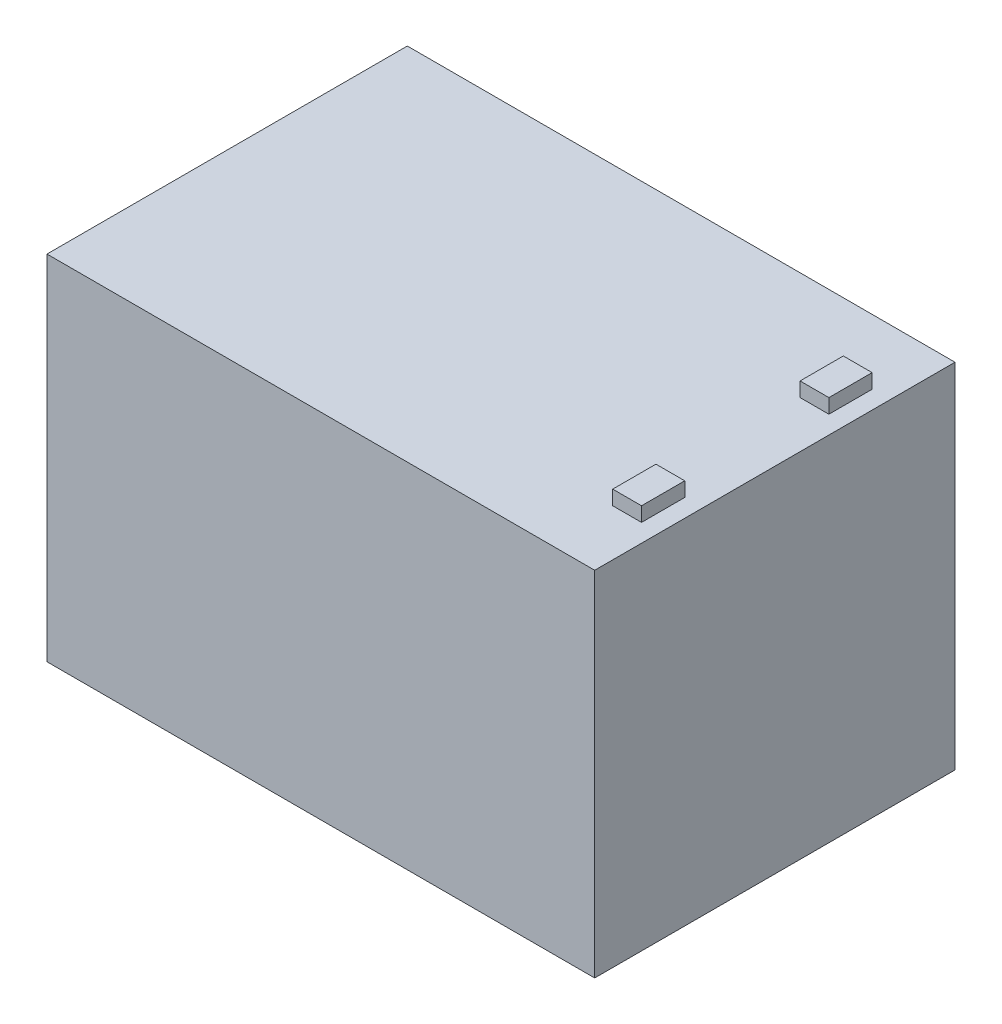
ISO-10303-21;
HEADER;
FILE_DESCRIPTION(('STEP AP214'),'2;1');
FILE_NAME('part.step','',(''),(''),'','','');
FILE_SCHEMA(('AUTOMOTIVE_DESIGN { 1 0 10303 214 1 1 1 1 }'));
ENDSEC;
DATA;
#1=APPLICATION_CONTEXT('core data for automotive mechanical design processes');
#2=APPLICATION_PROTOCOL_DEFINITION('international standard','automotive_design',2000,#1);
#3=PRODUCT_CONTEXT('',#1,'mechanical');
#4=PRODUCT('Part','Part','',(#3));
#5=PRODUCT_RELATED_PRODUCT_CATEGORY('part','',(#4));
#6=PRODUCT_DEFINITION_FORMATION('','',#4);
#7=PRODUCT_DEFINITION_CONTEXT('part definition',#1,'design');
#8=PRODUCT_DEFINITION('design','',#6,#7);
#9=PRODUCT_DEFINITION_SHAPE('','',#8);
#10=(LENGTH_UNIT() NAMED_UNIT(*) SI_UNIT(.MILLI.,.METRE.));
#11=(NAMED_UNIT(*) PLANE_ANGLE_UNIT() SI_UNIT($,.RADIAN.));
#12=(NAMED_UNIT(*) SI_UNIT($,.STERADIAN.) SOLID_ANGLE_UNIT());
#13=UNCERTAINTY_MEASURE_WITH_UNIT(LENGTH_MEASURE(1.E-05),#10,'distance_accuracy_value','');
#14=(GEOMETRIC_REPRESENTATION_CONTEXT(3) GLOBAL_UNCERTAINTY_ASSIGNED_CONTEXT((#13)) GLOBAL_UNIT_ASSIGNED_CONTEXT((#10,
#11,#12)) REPRESENTATION_CONTEXT('',''));
#15=CARTESIAN_POINT('',(0.,0.,0.));
#16=DIRECTION('',(0.,0.,1.));
#17=DIRECTION('',(1.,0.,0.));
#18=AXIS2_PLACEMENT_3D('',#15,#16,#17);
#19=CARTESIAN_POINT('',(-76.,49.,100.));
#20=DIRECTION('',(0.,-1.,0.));
#21=DIRECTION('',(0.,0.,-1.));
#22=AXIS2_PLACEMENT_3D('',#19,#20,#21);
#23=PLANE('',#22);
#24=DIRECTION('',(0.,0.,-1.));
#25=VECTOR('',#24,1.);
#26=CARTESIAN_POINT('',(71.,49.,18.));
#27=LINE('',#26,#25);
#28=CARTESIAN_POINT('',(71.,49.,30.));
#29=VERTEX_POINT('',#28);
#30=CARTESIAN_POINT('',(71.,49.,18.));
#31=VERTEX_POINT('',#30);
#32=EDGE_CURVE('E145',#29,#31,#27,.T.);
#33=ORIENTED_EDGE('',*,*,#32,.F.);
#34=DIRECTION('',(1.,0.,0.));
#35=VECTOR('',#34,1.);
#36=CARTESIAN_POINT('',(63.,49.,30.));
#37=LINE('',#36,#35);
#38=CARTESIAN_POINT('',(63.,49.,30.));
#39=VERTEX_POINT('',#38);
#40=EDGE_CURVE('E158',#39,#29,#37,.T.);
#41=ORIENTED_EDGE('',*,*,#40,.F.);
#42=DIRECTION('',(0.,0.,1.));
#43=VECTOR('',#42,1.);
#44=CARTESIAN_POINT('',(63.,49.,18.));
#45=LINE('',#44,#43);
#46=CARTESIAN_POINT('',(63.,49.,18.));
#47=VERTEX_POINT('',#46);
#48=EDGE_CURVE('E167',#47,#39,#45,.T.);
#49=ORIENTED_EDGE('',*,*,#48,.F.);
#50=DIRECTION('',(-1.,0.,0.));
#51=VECTOR('',#50,1.);
#52=CARTESIAN_POINT('',(63.,49.,18.));
#53=LINE('',#52,#51);
#54=EDGE_CURVE('E148',#31,#47,#53,.T.);
#55=ORIENTED_EDGE('',*,*,#54,.F.);
#56=EDGE_LOOP('',(#33,#41,#49,#55));
#57=FACE_BOUND('',#56,.T.);
#58=DIRECTION('',(-1.,0.,0.));
#59=VECTOR('',#58,1.);
#60=CARTESIAN_POINT('',(-76.,49.,0.));
#61=LINE('',#60,#59);
#62=CARTESIAN_POINT('',(76.,49.,0.));
#63=VERTEX_POINT('',#62);
#64=CARTESIAN_POINT('',(-76.,49.,0.));
#65=VERTEX_POINT('',#64);
#66=EDGE_CURVE('E197',#63,#65,#61,.T.);
#67=ORIENTED_EDGE('',*,*,#66,.T.);
#68=DIRECTION('',(0.,0.,-1.));
#69=VECTOR('',#68,1.);
#70=CARTESIAN_POINT('',(-76.,49.,100.));
#71=LINE('',#70,#69);
#72=CARTESIAN_POINT('',(-76.,49.,100.));
#73=VERTEX_POINT('',#72);
#74=EDGE_CURVE('E43',#73,#65,#71,.T.);
#75=ORIENTED_EDGE('',*,*,#74,.F.);
#76=DIRECTION('',(-1.,0.,0.));
#77=VECTOR('',#76,1.);
#78=CARTESIAN_POINT('',(-76.,49.,100.));
#79=LINE('',#78,#77);
#80=CARTESIAN_POINT('',(76.,49.,100.));
#81=VERTEX_POINT('',#80);
#82=EDGE_CURVE('E187',#81,#73,#79,.T.);
#83=ORIENTED_EDGE('',*,*,#82,.F.);
#84=DIRECTION('',(0.,0.,-1.));
#85=VECTOR('',#84,1.);
#86=CARTESIAN_POINT('',(76.,49.,100.));
#87=LINE('',#86,#85);
#88=EDGE_CURVE('E11',#81,#63,#87,.T.);
#89=ORIENTED_EDGE('',*,*,#88,.T.);
#90=EDGE_LOOP('',(#67,#75,#83,#89));
#91=FACE_BOUND('',#90,.T.);
#92=DIRECTION('',(0.,0.,-1.));
#93=VECTOR('',#92,1.);
#94=CARTESIAN_POINT('',(71.,49.,70.));
#95=LINE('',#94,#93);
#96=CARTESIAN_POINT('',(71.,49.,82.));
#97=VERTEX_POINT('',#96);
#98=CARTESIAN_POINT('',(71.,49.,70.));
#99=VERTEX_POINT('',#98);
#100=EDGE_CURVE('E144',#97,#99,#95,.T.);
#101=ORIENTED_EDGE('',*,*,#100,.F.);
#102=DIRECTION('',(1.,0.,0.));
#103=VECTOR('',#102,1.);
#104=CARTESIAN_POINT('',(63.,49.,82.));
#105=LINE('',#104,#103);
#106=CARTESIAN_POINT('',(63.,49.,82.));
#107=VERTEX_POINT('',#106);
#108=EDGE_CURVE('E141',#107,#97,#105,.T.);
#109=ORIENTED_EDGE('',*,*,#108,.F.);
#110=DIRECTION('',(0.,0.,1.));
#111=VECTOR('',#110,1.);
#112=CARTESIAN_POINT('',(63.,49.,70.));
#113=LINE('',#112,#111);
#114=CARTESIAN_POINT('',(63.,49.,70.));
#115=VERTEX_POINT('',#114);
#116=EDGE_CURVE('E55',#115,#107,#113,.T.);
#117=ORIENTED_EDGE('',*,*,#116,.F.);
#118=DIRECTION('',(-1.,0.,0.));
#119=VECTOR('',#118,1.);
#120=CARTESIAN_POINT('',(63.,49.,70.));
#121=LINE('',#120,#119);
#122=EDGE_CURVE('E50',#99,#115,#121,.T.);
#123=ORIENTED_EDGE('',*,*,#122,.F.);
#124=EDGE_LOOP('',(#101,#109,#117,#123));
#125=FACE_BOUND('',#124,.T.);
#126=ADVANCED_FACE('F35',(#57,#91,#125),#23,.F.);
#127=CARTESIAN_POINT('',(76.,-49.,100.));
#128=DIRECTION('',(-1.,0.,0.));
#129=DIRECTION('',(0.,0.,1.));
#130=AXIS2_PLACEMENT_3D('',#127,#128,#129);
#131=PLANE('',#130);
#132=DIRECTION('',(0.,1.,0.));
#133=VECTOR('',#132,1.);
#134=CARTESIAN_POINT('',(76.,-49.,0.));
#135=LINE('',#134,#133);
#136=CARTESIAN_POINT('',(76.,-49.,0.));
#137=VERTEX_POINT('',#136);
#138=EDGE_CURVE('E183',#137,#63,#135,.T.);
#139=ORIENTED_EDGE('',*,*,#138,.T.);
#140=ORIENTED_EDGE('',*,*,#88,.F.);
#141=DIRECTION('',(0.,1.,0.));
#142=VECTOR('',#141,1.);
#143=CARTESIAN_POINT('',(76.,-49.,100.));
#144=LINE('',#143,#142);
#145=CARTESIAN_POINT('',(76.,-49.,100.));
#146=VERTEX_POINT('',#145);
#147=EDGE_CURVE('E184',#146,#81,#144,.T.);
#148=ORIENTED_EDGE('',*,*,#147,.F.);
#149=DIRECTION('',(0.,0.,-1.));
#150=VECTOR('',#149,1.);
#151=CARTESIAN_POINT('',(76.,-49.,100.));
#152=LINE('',#151,#150);
#153=EDGE_CURVE('E194',#146,#137,#152,.T.);
#154=ORIENTED_EDGE('',*,*,#153,.T.);
#155=EDGE_LOOP('',(#139,#140,#148,#154));
#156=FACE_BOUND('',#155,.T.);
#157=ADVANCED_FACE('F37',(#156),#131,.F.);
#158=CARTESIAN_POINT('',(-76.,-49.,100.));
#159=DIRECTION('',(1.,0.,0.));
#160=DIRECTION('',(0.,0.,-1.));
#161=AXIS2_PLACEMENT_3D('',#158,#159,#160);
#162=PLANE('',#161);
#163=DIRECTION('',(0.,-1.,0.));
#164=VECTOR('',#163,1.);
#165=CARTESIAN_POINT('',(-76.,-49.,0.));
#166=LINE('',#165,#164);
#167=CARTESIAN_POINT('',(-76.,-49.,0.));
#168=VERTEX_POINT('',#167);
#169=EDGE_CURVE('E199',#65,#168,#166,.T.);
#170=ORIENTED_EDGE('',*,*,#169,.T.);
#171=DIRECTION('',(0.,0.,-1.));
#172=VECTOR('',#171,1.);
#173=CARTESIAN_POINT('',(-76.,-49.,100.));
#174=LINE('',#173,#172);
#175=CARTESIAN_POINT('',(-76.,-49.,100.));
#176=VERTEX_POINT('',#175);
#177=EDGE_CURVE('E204',#176,#168,#174,.T.);
#178=ORIENTED_EDGE('',*,*,#177,.F.);
#179=DIRECTION('',(0.,-1.,0.));
#180=VECTOR('',#179,1.);
#181=CARTESIAN_POINT('',(-76.,-49.,100.));
#182=LINE('',#181,#180);
#183=EDGE_CURVE('E190',#73,#176,#182,.T.);
#184=ORIENTED_EDGE('',*,*,#183,.F.);
#185=ORIENTED_EDGE('',*,*,#74,.T.);
#186=EDGE_LOOP('',(#170,#178,#184,#185));
#187=FACE_BOUND('',#186,.T.);
#188=ADVANCED_FACE('F211',(#187),#162,.F.);
#189=CARTESIAN_POINT('',(-76.,-49.,100.));
#190=DIRECTION('',(0.,1.,0.));
#191=DIRECTION('',(0.,0.,1.));
#192=AXIS2_PLACEMENT_3D('',#189,#190,#191);
#193=PLANE('',#192);
#194=DIRECTION('',(1.,0.,0.));
#195=VECTOR('',#194,1.);
#196=CARTESIAN_POINT('',(-76.,-49.,0.));
#197=LINE('',#196,#195);
#198=EDGE_CURVE('E188',#168,#137,#197,.T.);
#199=ORIENTED_EDGE('',*,*,#198,.T.);
#200=ORIENTED_EDGE('',*,*,#153,.F.);
#201=DIRECTION('',(1.,0.,0.));
#202=VECTOR('',#201,1.);
#203=CARTESIAN_POINT('',(-76.,-49.,100.));
#204=LINE('',#203,#202);
#205=EDGE_CURVE('E192',#176,#146,#204,.T.);
#206=ORIENTED_EDGE('',*,*,#205,.F.);
#207=ORIENTED_EDGE('',*,*,#177,.T.);
#208=EDGE_LOOP('',(#199,#200,#206,#207));
#209=FACE_BOUND('',#208,.T.);
#210=ADVANCED_FACE('F220',(#209),#193,.F.);
#211=CARTESIAN_POINT('',(0.,0.,100.));
#212=DIRECTION('',(0.,0.,-1.));
#213=DIRECTION('',(-1.,0.,0.));
#214=AXIS2_PLACEMENT_3D('',#211,#212,#213);
#215=PLANE('',#214);
#216=ORIENTED_EDGE('',*,*,#147,.T.);
#217=ORIENTED_EDGE('',*,*,#82,.T.);
#218=ORIENTED_EDGE('',*,*,#183,.T.);
#219=ORIENTED_EDGE('',*,*,#205,.T.);
#220=EDGE_LOOP('',(#216,#217,#218,#219));
#221=FACE_BOUND('',#220,.T.);
#222=ADVANCED_FACE('F226',(#221),#215,.F.);
#223=CARTESIAN_POINT('',(0.,0.,0.));
#224=DIRECTION('',(0.,0.,-1.));
#225=DIRECTION('',(-1.,0.,0.));
#226=AXIS2_PLACEMENT_3D('',#223,#224,#225);
#227=PLANE('',#226);
#228=ORIENTED_EDGE('',*,*,#138,.F.);
#229=ORIENTED_EDGE('',*,*,#198,.F.);
#230=ORIENTED_EDGE('',*,*,#169,.F.);
#231=ORIENTED_EDGE('',*,*,#66,.F.);
#232=EDGE_LOOP('',(#228,#229,#230,#231));
#233=FACE_BOUND('',#232,.T.);
#234=ADVANCED_FACE('F217',(#233),#227,.T.);
#235=CARTESIAN_POINT('',(71.,53.,18.));
#236=DIRECTION('',(-1.,0.,0.));
#237=DIRECTION('',(0.,0.,1.));
#238=AXIS2_PLACEMENT_3D('',#235,#236,#237);
#239=PLANE('',#238);
#240=ORIENTED_EDGE('',*,*,#32,.T.);
#241=DIRECTION('',(0.,-1.,0.));
#242=VECTOR('',#241,1.);
#243=CARTESIAN_POINT('',(71.,53.,18.));
#244=LINE('',#243,#242);
#245=CARTESIAN_POINT('',(71.,53.,18.));
#246=VERTEX_POINT('',#245);
#247=EDGE_CURVE('E180',#246,#31,#244,.T.);
#248=ORIENTED_EDGE('',*,*,#247,.F.);
#249=DIRECTION('',(0.,0.,-1.));
#250=VECTOR('',#249,1.);
#251=CARTESIAN_POINT('',(71.,53.,18.));
#252=LINE('',#251,#250);
#253=CARTESIAN_POINT('',(71.,53.,30.));
#254=VERTEX_POINT('',#253);
#255=EDGE_CURVE('E154',#254,#246,#252,.T.);
#256=ORIENTED_EDGE('',*,*,#255,.F.);
#257=DIRECTION('',(0.,-1.,0.));
#258=VECTOR('',#257,1.);
#259=CARTESIAN_POINT('',(71.,53.,30.));
#260=LINE('',#259,#258);
#261=EDGE_CURVE('E163',#254,#29,#260,.T.);
#262=ORIENTED_EDGE('',*,*,#261,.T.);
#263=EDGE_LOOP('',(#240,#248,#256,#262));
#264=FACE_BOUND('',#263,.T.);
#265=ADVANCED_FACE('F271',(#264),#239,.F.);
#266=CARTESIAN_POINT('',(63.,53.,18.));
#267=DIRECTION('',(0.,0.,1.));
#268=DIRECTION('',(1.,0.,0.));
#269=AXIS2_PLACEMENT_3D('',#266,#267,#268);
#270=PLANE('',#269);
#271=ORIENTED_EDGE('',*,*,#54,.T.);
#272=DIRECTION('',(0.,-1.,0.));
#273=VECTOR('',#272,1.);
#274=CARTESIAN_POINT('',(63.,53.,18.));
#275=LINE('',#274,#273);
#276=CARTESIAN_POINT('',(63.,53.,18.));
#277=VERTEX_POINT('',#276);
#278=EDGE_CURVE('E177',#277,#47,#275,.T.);
#279=ORIENTED_EDGE('',*,*,#278,.F.);
#280=DIRECTION('',(-1.,0.,0.));
#281=VECTOR('',#280,1.);
#282=CARTESIAN_POINT('',(63.,53.,18.));
#283=LINE('',#282,#281);
#284=EDGE_CURVE('E157',#246,#277,#283,.T.);
#285=ORIENTED_EDGE('',*,*,#284,.F.);
#286=ORIENTED_EDGE('',*,*,#247,.T.);
#287=EDGE_LOOP('',(#271,#279,#285,#286));
#288=FACE_BOUND('',#287,.T.);
#289=ADVANCED_FACE('F267',(#288),#270,.F.);
#290=CARTESIAN_POINT('',(63.,53.,18.));
#291=DIRECTION('',(1.,0.,0.));
#292=DIRECTION('',(0.,0.,-1.));
#293=AXIS2_PLACEMENT_3D('',#290,#291,#292);
#294=PLANE('',#293);
#295=ORIENTED_EDGE('',*,*,#48,.T.);
#296=DIRECTION('',(0.,-1.,0.));
#297=VECTOR('',#296,1.);
#298=CARTESIAN_POINT('',(63.,53.,30.));
#299=LINE('',#298,#297);
#300=CARTESIAN_POINT('',(63.,53.,30.));
#301=VERTEX_POINT('',#300);
#302=EDGE_CURVE('E174',#301,#39,#299,.T.);
#303=ORIENTED_EDGE('',*,*,#302,.F.);
#304=DIRECTION('',(0.,0.,1.));
#305=VECTOR('',#304,1.);
#306=CARTESIAN_POINT('',(63.,53.,18.));
#307=LINE('',#306,#305);
#308=EDGE_CURVE('E160',#277,#301,#307,.T.);
#309=ORIENTED_EDGE('',*,*,#308,.F.);
#310=ORIENTED_EDGE('',*,*,#278,.T.);
#311=EDGE_LOOP('',(#295,#303,#309,#310));
#312=FACE_BOUND('',#311,.T.);
#313=ADVANCED_FACE('F263',(#312),#294,.F.);
#314=CARTESIAN_POINT('',(63.,53.,30.));
#315=DIRECTION('',(0.,0.,-1.));
#316=DIRECTION('',(-1.,0.,0.));
#317=AXIS2_PLACEMENT_3D('',#314,#315,#316);
#318=PLANE('',#317);
#319=ORIENTED_EDGE('',*,*,#40,.T.);
#320=ORIENTED_EDGE('',*,*,#261,.F.);
#321=DIRECTION('',(1.,0.,0.));
#322=VECTOR('',#321,1.);
#323=CARTESIAN_POINT('',(63.,53.,30.));
#324=LINE('',#323,#322);
#325=EDGE_CURVE('E162',#301,#254,#324,.T.);
#326=ORIENTED_EDGE('',*,*,#325,.F.);
#327=ORIENTED_EDGE('',*,*,#302,.T.);
#328=EDGE_LOOP('',(#319,#320,#326,#327));
#329=FACE_BOUND('',#328,.T.);
#330=ADVANCED_FACE('F259',(#329),#318,.F.);
#331=CARTESIAN_POINT('',(0.,53.,0.));
#332=DIRECTION('',(0.,1.,0.));
#333=DIRECTION('',(0.,0.,1.));
#334=AXIS2_PLACEMENT_3D('',#331,#332,#333);
#335=PLANE('',#334);
#336=ORIENTED_EDGE('',*,*,#255,.T.);
#337=ORIENTED_EDGE('',*,*,#284,.T.);
#338=ORIENTED_EDGE('',*,*,#308,.T.);
#339=ORIENTED_EDGE('',*,*,#325,.T.);
#340=EDGE_LOOP('',(#336,#337,#338,#339));
#341=FACE_BOUND('',#340,.T.);
#342=ADVANCED_FACE('F256',(#341),#335,.T.);
#343=CARTESIAN_POINT('',(71.,53.,70.));
#344=DIRECTION('',(-1.,0.,0.));
#345=DIRECTION('',(0.,0.,1.));
#346=AXIS2_PLACEMENT_3D('',#343,#344,#345);
#347=PLANE('',#346);
#348=ORIENTED_EDGE('',*,*,#100,.T.);
#349=DIRECTION('',(0.,-1.,0.));
#350=VECTOR('',#349,1.);
#351=CARTESIAN_POINT('',(71.,53.,70.));
#352=LINE('',#351,#350);
#353=CARTESIAN_POINT('',(71.,53.,70.));
#354=VERTEX_POINT('',#353);
#355=EDGE_CURVE('E125',#354,#99,#352,.T.);
#356=ORIENTED_EDGE('',*,*,#355,.F.);
#357=DIRECTION('',(0.,0.,-1.));
#358=VECTOR('',#357,1.);
#359=CARTESIAN_POINT('',(71.,53.,70.));
#360=LINE('',#359,#358);
#361=CARTESIAN_POINT('',(71.,53.,82.));
#362=VERTEX_POINT('',#361);
#363=EDGE_CURVE('E132',#362,#354,#360,.T.);
#364=ORIENTED_EDGE('',*,*,#363,.F.);
#365=DIRECTION('',(0.,-1.,0.));
#366=VECTOR('',#365,1.);
#367=CARTESIAN_POINT('',(71.,53.,82.));
#368=LINE('',#367,#366);
#369=EDGE_CURVE('E234',#362,#97,#368,.T.);
#370=ORIENTED_EDGE('',*,*,#369,.T.);
#371=EDGE_LOOP('',(#348,#356,#364,#370));
#372=FACE_BOUND('',#371,.T.);
#373=ADVANCED_FACE('F143',(#372),#347,.F.);
#374=CARTESIAN_POINT('',(63.,53.,70.));
#375=DIRECTION('',(0.,0.,1.));
#376=DIRECTION('',(1.,0.,0.));
#377=AXIS2_PLACEMENT_3D('',#374,#375,#376);
#378=PLANE('',#377);
#379=ORIENTED_EDGE('',*,*,#122,.T.);
#380=DIRECTION('',(0.,-1.,0.));
#381=VECTOR('',#380,1.);
#382=CARTESIAN_POINT('',(63.,53.,70.));
#383=LINE('',#382,#381);
#384=CARTESIAN_POINT('',(63.,53.,70.));
#385=VERTEX_POINT('',#384);
#386=EDGE_CURVE('E128',#385,#115,#383,.T.);
#387=ORIENTED_EDGE('',*,*,#386,.F.);
#388=DIRECTION('',(-1.,0.,0.));
#389=VECTOR('',#388,1.);
#390=CARTESIAN_POINT('',(63.,53.,70.));
#391=LINE('',#390,#389);
#392=EDGE_CURVE('E121',#354,#385,#391,.T.);
#393=ORIENTED_EDGE('',*,*,#392,.F.);
#394=ORIENTED_EDGE('',*,*,#355,.T.);
#395=EDGE_LOOP('',(#379,#387,#393,#394));
#396=FACE_BOUND('',#395,.T.);
#397=ADVANCED_FACE('F123',(#396),#378,.F.);
#398=CARTESIAN_POINT('',(63.,53.,70.));
#399=DIRECTION('',(1.,0.,0.));
#400=DIRECTION('',(0.,0.,-1.));
#401=AXIS2_PLACEMENT_3D('',#398,#399,#400);
#402=PLANE('',#401);
#403=ORIENTED_EDGE('',*,*,#116,.T.);
#404=DIRECTION('',(0.,-1.,0.));
#405=VECTOR('',#404,1.);
#406=CARTESIAN_POINT('',(63.,53.,82.));
#407=LINE('',#406,#405);
#408=CARTESIAN_POINT('',(63.,53.,82.));
#409=VERTEX_POINT('',#408);
#410=EDGE_CURVE('E150',#409,#107,#407,.T.);
#411=ORIENTED_EDGE('',*,*,#410,.F.);
#412=DIRECTION('',(0.,0.,1.));
#413=VECTOR('',#412,1.);
#414=CARTESIAN_POINT('',(63.,53.,70.));
#415=LINE('',#414,#413);
#416=EDGE_CURVE('E131',#385,#409,#415,.T.);
#417=ORIENTED_EDGE('',*,*,#416,.F.);
#418=ORIENTED_EDGE('',*,*,#386,.T.);
#419=EDGE_LOOP('',(#403,#411,#417,#418));
#420=FACE_BOUND('',#419,.T.);
#421=ADVANCED_FACE('F243',(#420),#402,.F.);
#422=CARTESIAN_POINT('',(63.,53.,82.));
#423=DIRECTION('',(0.,0.,-1.));
#424=DIRECTION('',(-1.,0.,0.));
#425=AXIS2_PLACEMENT_3D('',#422,#423,#424);
#426=PLANE('',#425);
#427=ORIENTED_EDGE('',*,*,#108,.T.);
#428=ORIENTED_EDGE('',*,*,#369,.F.);
#429=DIRECTION('',(1.,0.,0.));
#430=VECTOR('',#429,1.);
#431=CARTESIAN_POINT('',(63.,53.,82.));
#432=LINE('',#431,#430);
#433=EDGE_CURVE('E137',#409,#362,#432,.T.);
#434=ORIENTED_EDGE('',*,*,#433,.F.);
#435=ORIENTED_EDGE('',*,*,#410,.T.);
#436=EDGE_LOOP('',(#427,#428,#434,#435));
#437=FACE_BOUND('',#436,.T.);
#438=ADVANCED_FACE('F233',(#437),#426,.F.);
#439=CARTESIAN_POINT('',(0.,53.,0.));
#440=DIRECTION('',(0.,1.,0.));
#441=DIRECTION('',(0.,0.,1.));
#442=AXIS2_PLACEMENT_3D('',#439,#440,#441);
#443=PLANE('',#442);
#444=ORIENTED_EDGE('',*,*,#363,.T.);
#445=ORIENTED_EDGE('',*,*,#392,.T.);
#446=ORIENTED_EDGE('',*,*,#416,.T.);
#447=ORIENTED_EDGE('',*,*,#433,.T.);
#448=EDGE_LOOP('',(#444,#445,#446,#447));
#449=FACE_BOUND('',#448,.T.);
#450=ADVANCED_FACE('F135',(#449),#443,.T.);
#451=CLOSED_SHELL('',(#126,#157,#188,#210,#222,#234,#265,#289,#313,#330,#342,#373,#397,#421,
#438,#450));
#452=MANIFOLD_SOLID_BREP('B2',#451);
#453=ADVANCED_BREP_SHAPE_REPRESENTATION('',(#18,#452),#14);
#454=SHAPE_DEFINITION_REPRESENTATION(#9,#453);
ENDSEC;
END-ISO-10303-21;
